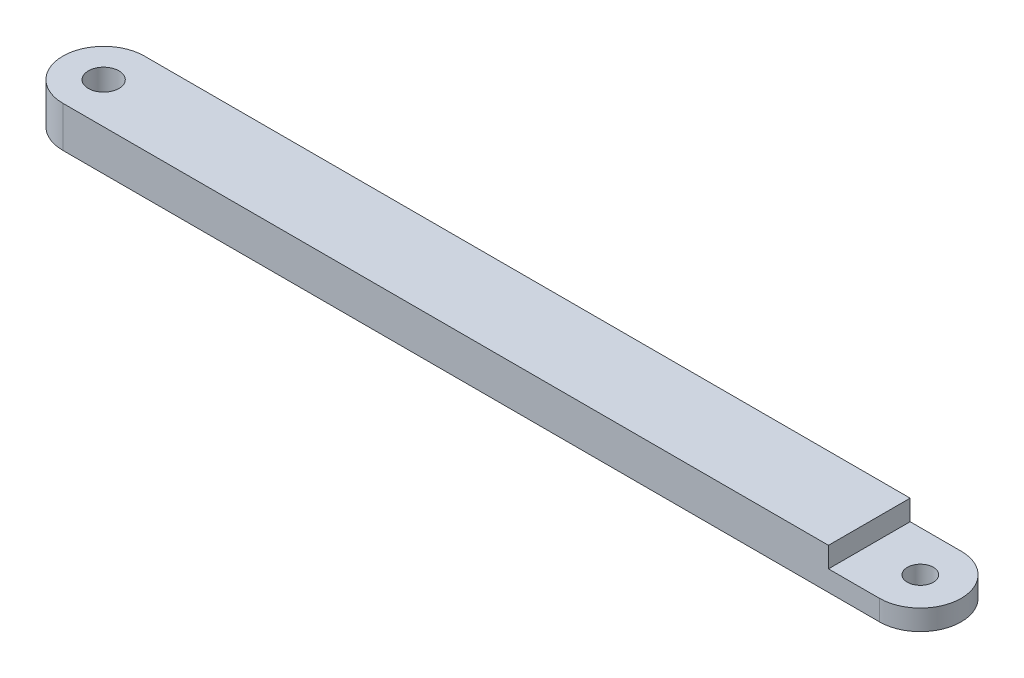
ISO-10303-21;
HEADER;
FILE_DESCRIPTION(('STEP AP214'),'2;1');
FILE_NAME('part.step','',(''),(''),'','','');
FILE_SCHEMA(('AUTOMOTIVE_DESIGN { 1 0 10303 214 1 1 1 1 }'));
ENDSEC;
DATA;
#1=APPLICATION_CONTEXT('core data for automotive mechanical design processes');
#2=APPLICATION_PROTOCOL_DEFINITION('international standard','automotive_design',2000,#1);
#3=PRODUCT_CONTEXT('',#1,'mechanical');
#4=PRODUCT('Part','Part','',(#3));
#5=PRODUCT_RELATED_PRODUCT_CATEGORY('part','',(#4));
#6=PRODUCT_DEFINITION_FORMATION('','',#4);
#7=PRODUCT_DEFINITION_CONTEXT('part definition',#1,'design');
#8=PRODUCT_DEFINITION('design','',#6,#7);
#9=PRODUCT_DEFINITION_SHAPE('','',#8);
#10=(LENGTH_UNIT() NAMED_UNIT(*) SI_UNIT(.MILLI.,.METRE.));
#11=(NAMED_UNIT(*) PLANE_ANGLE_UNIT() SI_UNIT($,.RADIAN.));
#12=(NAMED_UNIT(*) SI_UNIT($,.STERADIAN.) SOLID_ANGLE_UNIT());
#13=UNCERTAINTY_MEASURE_WITH_UNIT(LENGTH_MEASURE(1.E-05),#10,'distance_accuracy_value','');
#14=(GEOMETRIC_REPRESENTATION_CONTEXT(3) GLOBAL_UNCERTAINTY_ASSIGNED_CONTEXT((#13)) GLOBAL_UNIT_ASSIGNED_CONTEXT((#10,
#11,#12)) REPRESENTATION_CONTEXT('',''));
#15=CARTESIAN_POINT('',(0.,0.,0.));
#16=DIRECTION('',(0.,0.,1.));
#17=DIRECTION('',(1.,0.,0.));
#18=AXIS2_PLACEMENT_3D('',#15,#16,#17);
#19=CARTESIAN_POINT('',(63.5,6.35,0.));
#20=DIRECTION('',(0.,-1.,0.));
#21=DIRECTION('',(0.,0.,-1.));
#22=AXIS2_PLACEMENT_3D('',#19,#20,#21);
#23=CYLINDRICAL_SURFACE('',#22,6.35);
#24=CARTESIAN_POINT('',(63.5,3.175,0.));
#25=DIRECTION('',(0.,1.,0.));
#26=DIRECTION('',(0.,0.,1.));
#27=AXIS2_PLACEMENT_3D('',#24,#25,#26);
#28=CIRCLE('',#27,6.35);
#29=CARTESIAN_POINT('',(63.5,3.175,6.34999999999998));
#30=VERTEX_POINT('',#29);
#31=CARTESIAN_POINT('',(63.5,3.175,-6.35000000000002));
#32=VERTEX_POINT('',#31);
#33=EDGE_CURVE('E114',#30,#32,#28,.T.);
#34=ORIENTED_EDGE('',*,*,#33,.F.);
#35=DIRECTION('',(0.,-1.,0.));
#36=VECTOR('',#35,1.);
#37=CARTESIAN_POINT('',(63.5,6.35,6.34999999999998));
#38=LINE('',#37,#36);
#39=CARTESIAN_POINT('',(63.5,0.,6.34999999999998));
#40=VERTEX_POINT('',#39);
#41=EDGE_CURVE('E42',#30,#40,#38,.T.);
#42=ORIENTED_EDGE('',*,*,#41,.T.);
#43=CARTESIAN_POINT('',(63.5,0.,0.));
#44=DIRECTION('',(0.,1.,0.));
#45=DIRECTION('',(0.,0.,1.));
#46=AXIS2_PLACEMENT_3D('',#43,#44,#45);
#47=CIRCLE('',#46,6.35);
#48=CARTESIAN_POINT('',(63.5,0.,-6.35000000000002));
#49=VERTEX_POINT('',#48);
#50=EDGE_CURVE('E89',#40,#49,#47,.T.);
#51=ORIENTED_EDGE('',*,*,#50,.T.);
#52=DIRECTION('',(0.,-1.,0.));
#53=VECTOR('',#52,1.);
#54=CARTESIAN_POINT('',(63.5,6.35,-6.35000000000002));
#55=LINE('',#54,#53);
#56=EDGE_CURVE('E83',#32,#49,#55,.T.);
#57=ORIENTED_EDGE('',*,*,#56,.F.);
#58=EDGE_LOOP('',(#34,#42,#51,#57));
#59=FACE_BOUND('',#58,.T.);
#60=ADVANCED_FACE('F33',(#59),#23,.T.);
#61=CARTESIAN_POINT('',(63.5,6.35,0.));
#62=DIRECTION('',(0.,1.,0.));
#63=DIRECTION('',(0.,0.,1.));
#64=AXIS2_PLACEMENT_3D('',#61,#62,#63);
#65=CYLINDRICAL_SURFACE('',#64,2.0193);
#66=CARTESIAN_POINT('',(63.5,0.,0.));
#67=DIRECTION('',(0.,1.,0.));
#68=DIRECTION('',(0.,0.,1.));
#69=AXIS2_PLACEMENT_3D('',#66,#67,#68);
#70=CIRCLE('',#69,2.0193);
#71=CARTESIAN_POINT('',(63.5,0.,2.01929999999998));
#72=VERTEX_POINT('',#71);
#73=EDGE_CURVE('E130',#72,#72,#70,.T.);
#74=ORIENTED_EDGE('',*,*,#73,.F.);
#75=EDGE_LOOP('',(#74));
#76=FACE_BOUND('',#75,.T.);
#77=CARTESIAN_POINT('',(63.5,3.175,0.));
#78=DIRECTION('',(0.,1.,0.));
#79=DIRECTION('',(0.,0.,1.));
#80=AXIS2_PLACEMENT_3D('',#77,#78,#79);
#81=CIRCLE('',#80,2.0193);
#82=CARTESIAN_POINT('',(63.5,3.175,2.01929999999998));
#83=VERTEX_POINT('',#82);
#84=EDGE_CURVE('E37',#83,#83,#81,.F.);
#85=ORIENTED_EDGE('',*,*,#84,.F.);
#86=EDGE_LOOP('',(#85));
#87=FACE_BOUND('',#86,.T.);
#88=ADVANCED_FACE('F166',(#76,#87),#65,.F.);
#89=CARTESIAN_POINT('',(-63.5,6.35,0.));
#90=DIRECTION('',(0.,-1.,0.));
#91=DIRECTION('',(0.,0.,-1.));
#92=AXIS2_PLACEMENT_3D('',#89,#90,#91);
#93=CYLINDRICAL_SURFACE('',#92,6.35);
#94=CARTESIAN_POINT('',(-63.5,0.,0.));
#95=DIRECTION('',(0.,1.,0.));
#96=DIRECTION('',(0.,0.,1.));
#97=AXIS2_PLACEMENT_3D('',#94,#95,#96);
#98=CIRCLE('',#97,6.35);
#99=CARTESIAN_POINT('',(-63.5,0.,-6.35));
#100=VERTEX_POINT('',#99);
#101=CARTESIAN_POINT('',(-63.5,0.,6.35));
#102=VERTEX_POINT('',#101);
#103=EDGE_CURVE('E94',#100,#102,#98,.T.);
#104=ORIENTED_EDGE('',*,*,#103,.T.);
#105=DIRECTION('',(0.,-1.,0.));
#106=VECTOR('',#105,1.);
#107=CARTESIAN_POINT('',(-63.5,6.35,6.35));
#108=LINE('',#107,#106);
#109=CARTESIAN_POINT('',(-63.5,6.35,6.35));
#110=VERTEX_POINT('',#109);
#111=EDGE_CURVE('E11',#110,#102,#108,.T.);
#112=ORIENTED_EDGE('',*,*,#111,.F.);
#113=CARTESIAN_POINT('',(-63.5,6.35,0.));
#114=DIRECTION('',(0.,1.,0.));
#115=DIRECTION('',(0.,0.,1.));
#116=AXIS2_PLACEMENT_3D('',#113,#114,#115);
#117=CIRCLE('',#116,6.35);
#118=CARTESIAN_POINT('',(-63.5,6.35,-6.35));
#119=VERTEX_POINT('',#118);
#120=EDGE_CURVE('E88',#119,#110,#117,.T.);
#121=ORIENTED_EDGE('',*,*,#120,.F.);
#122=DIRECTION('',(0.,-1.,0.));
#123=VECTOR('',#122,1.);
#124=CARTESIAN_POINT('',(-63.5,6.35,-6.35));
#125=LINE('',#124,#123);
#126=EDGE_CURVE('E79',#119,#100,#125,.T.);
#127=ORIENTED_EDGE('',*,*,#126,.T.);
#128=EDGE_LOOP('',(#104,#112,#121,#127));
#129=FACE_BOUND('',#128,.T.);
#130=ADVANCED_FACE('F35',(#129),#93,.T.);
#131=CARTESIAN_POINT('',(-63.5,6.35,6.35));
#132=DIRECTION('',(0.,0.,-1.));
#133=DIRECTION('',(-1.,0.,0.));
#134=AXIS2_PLACEMENT_3D('',#131,#132,#133);
#135=PLANE('',#134);
#136=DIRECTION('',(1.,0.,0.));
#137=VECTOR('',#136,1.);
#138=CARTESIAN_POINT('',(71.4375,3.175,6.34999999999998));
#139=LINE('',#138,#137);
#140=CARTESIAN_POINT('',(55.5625,3.175,6.34999999999998));
#141=VERTEX_POINT('',#140);
#142=EDGE_CURVE('E142',#141,#30,#139,.T.);
#143=ORIENTED_EDGE('',*,*,#142,.F.);
#144=DIRECTION('',(0.,1.,0.));
#145=VECTOR('',#144,1.);
#146=CARTESIAN_POINT('',(55.5625,3.175,6.34999999999998));
#147=LINE('',#146,#145);
#148=CARTESIAN_POINT('',(55.5625,6.35,6.34999999999998));
#149=VERTEX_POINT('',#148);
#150=EDGE_CURVE('E123',#141,#149,#147,.T.);
#151=ORIENTED_EDGE('',*,*,#150,.T.);
#152=DIRECTION('',(1.,0.,0.));
#153=VECTOR('',#152,1.);
#154=CARTESIAN_POINT('',(-63.5,6.35,6.35));
#155=LINE('',#154,#153);
#156=EDGE_CURVE('E120',#110,#149,#155,.T.);
#157=ORIENTED_EDGE('',*,*,#156,.F.);
#158=ORIENTED_EDGE('',*,*,#111,.T.);
#159=DIRECTION('',(1.,0.,0.));
#160=VECTOR('',#159,1.);
#161=CARTESIAN_POINT('',(-63.5,0.,6.35));
#162=LINE('',#161,#160);
#163=EDGE_CURVE('E98',#102,#40,#162,.T.);
#164=ORIENTED_EDGE('',*,*,#163,.T.);
#165=ORIENTED_EDGE('',*,*,#41,.F.);
#166=EDGE_LOOP('',(#143,#151,#157,#158,#164,#165));
#167=FACE_BOUND('',#166,.T.);
#168=ADVANCED_FACE('F117',(#167),#135,.F.);
#169=CARTESIAN_POINT('',(-63.5,6.35,-6.35));
#170=DIRECTION('',(0.,0.,1.));
#171=DIRECTION('',(1.,0.,0.));
#172=AXIS2_PLACEMENT_3D('',#169,#170,#171);
#173=PLANE('',#172);
#174=DIRECTION('',(-1.,0.,0.));
#175=VECTOR('',#174,1.);
#176=CARTESIAN_POINT('',(-63.5,6.35,-6.35));
#177=LINE('',#176,#175);
#178=CARTESIAN_POINT('',(55.5625,6.35,-6.35000000000002));
#179=VERTEX_POINT('',#178);
#180=EDGE_CURVE('E57',#179,#119,#177,.T.);
#181=ORIENTED_EDGE('',*,*,#180,.F.);
#182=DIRECTION('',(0.,1.,0.));
#183=VECTOR('',#182,1.);
#184=CARTESIAN_POINT('',(55.5625,3.175,-6.35000000000002));
#185=LINE('',#184,#183);
#186=CARTESIAN_POINT('',(55.5625,3.175,-6.35000000000002));
#187=VERTEX_POINT('',#186);
#188=EDGE_CURVE('E49',#187,#179,#185,.T.);
#189=ORIENTED_EDGE('',*,*,#188,.F.);
#190=DIRECTION('',(-1.,0.,0.));
#191=VECTOR('',#190,1.);
#192=CARTESIAN_POINT('',(71.4375,3.175,-6.35000000000002));
#193=LINE('',#192,#191);
#194=EDGE_CURVE('E135',#32,#187,#193,.T.);
#195=ORIENTED_EDGE('',*,*,#194,.F.);
#196=ORIENTED_EDGE('',*,*,#56,.T.);
#197=DIRECTION('',(-1.,0.,0.));
#198=VECTOR('',#197,1.);
#199=CARTESIAN_POINT('',(-63.5,0.,-6.35));
#200=LINE('',#199,#198);
#201=EDGE_CURVE('E76',#49,#100,#200,.T.);
#202=ORIENTED_EDGE('',*,*,#201,.T.);
#203=ORIENTED_EDGE('',*,*,#126,.F.);
#204=EDGE_LOOP('',(#181,#189,#195,#196,#202,#203));
#205=FACE_BOUND('',#204,.T.);
#206=ADVANCED_FACE('F78',(#205),#173,.F.);
#207=CARTESIAN_POINT('',(-63.5,6.35,0.));
#208=DIRECTION('',(0.,1.,0.));
#209=DIRECTION('',(0.,0.,1.));
#210=AXIS2_PLACEMENT_3D('',#207,#208,#209);
#211=PLANE('',#210);
#212=DIRECTION('',(0.,0.,1.));
#213=VECTOR('',#212,1.);
#214=CARTESIAN_POINT('',(55.5625,6.35,6.34999999999998));
#215=LINE('',#214,#213);
#216=EDGE_CURVE('E137',#179,#149,#215,.T.);
#217=ORIENTED_EDGE('',*,*,#216,.F.);
#218=ORIENTED_EDGE('',*,*,#180,.T.);
#219=ORIENTED_EDGE('',*,*,#120,.T.);
#220=ORIENTED_EDGE('',*,*,#156,.T.);
#221=EDGE_LOOP('',(#217,#218,#219,#220));
#222=FACE_BOUND('',#221,.T.);
#223=CARTESIAN_POINT('',(-63.5,6.35,0.));
#224=DIRECTION('',(0.,1.,0.));
#225=DIRECTION('',(0.,0.,1.));
#226=AXIS2_PLACEMENT_3D('',#223,#224,#225);
#227=CIRCLE('',#226,2.38125);
#228=CARTESIAN_POINT('',(-63.5,6.35,2.38125));
#229=VERTEX_POINT('',#228);
#230=EDGE_CURVE('E103',#229,#229,#227,.T.);
#231=ORIENTED_EDGE('',*,*,#230,.F.);
#232=EDGE_LOOP('',(#231));
#233=FACE_BOUND('',#232,.T.);
#234=ADVANCED_FACE('F124',(#222,#233),#211,.T.);
#235=CARTESIAN_POINT('',(-63.5,0.,0.));
#236=DIRECTION('',(0.,1.,0.));
#237=DIRECTION('',(0.,0.,1.));
#238=AXIS2_PLACEMENT_3D('',#235,#236,#237);
#239=PLANE('',#238);
#240=ORIENTED_EDGE('',*,*,#73,.T.);
#241=EDGE_LOOP('',(#240));
#242=FACE_BOUND('',#241,.T.);
#243=CARTESIAN_POINT('',(-63.5,0.,0.));
#244=DIRECTION('',(0.,1.,0.));
#245=DIRECTION('',(0.,0.,1.));
#246=AXIS2_PLACEMENT_3D('',#243,#244,#245);
#247=CIRCLE('',#246,2.38125);
#248=CARTESIAN_POINT('',(-63.5,0.,2.38125));
#249=VERTEX_POINT('',#248);
#250=EDGE_CURVE('E99',#249,#249,#247,.T.);
#251=ORIENTED_EDGE('',*,*,#250,.T.);
#252=EDGE_LOOP('',(#251));
#253=FACE_BOUND('',#252,.T.);
#254=ORIENTED_EDGE('',*,*,#103,.F.);
#255=ORIENTED_EDGE('',*,*,#201,.F.);
#256=ORIENTED_EDGE('',*,*,#50,.F.);
#257=ORIENTED_EDGE('',*,*,#163,.F.);
#258=EDGE_LOOP('',(#254,#255,#256,#257));
#259=FACE_BOUND('',#258,.T.);
#260=ADVANCED_FACE('F96',(#242,#253,#259),#239,.F.);
#261=CARTESIAN_POINT('',(-63.5,6.35,0.));
#262=DIRECTION('',(0.,1.,0.));
#263=DIRECTION('',(0.,0.,1.));
#264=AXIS2_PLACEMENT_3D('',#261,#262,#263);
#265=CYLINDRICAL_SURFACE('',#264,2.38125);
#266=ORIENTED_EDGE('',*,*,#250,.F.);
#267=EDGE_LOOP('',(#266));
#268=FACE_BOUND('',#267,.T.);
#269=ORIENTED_EDGE('',*,*,#230,.T.);
#270=EDGE_LOOP('',(#269));
#271=FACE_BOUND('',#270,.T.);
#272=ADVANCED_FACE('F161',(#268,#271),#265,.F.);
#273=CARTESIAN_POINT('',(0.,3.175,0.));
#274=DIRECTION('',(0.,1.,0.));
#275=DIRECTION('',(0.,0.,1.));
#276=AXIS2_PLACEMENT_3D('',#273,#274,#275);
#277=PLANE('',#276);
#278=ORIENTED_EDGE('',*,*,#84,.T.);
#279=EDGE_LOOP('',(#278));
#280=FACE_BOUND('',#279,.T.);
#281=ORIENTED_EDGE('',*,*,#33,.T.);
#282=ORIENTED_EDGE('',*,*,#194,.T.);
#283=DIRECTION('',(0.,0.,1.));
#284=VECTOR('',#283,1.);
#285=CARTESIAN_POINT('',(55.5625,3.175,6.34999999999998));
#286=LINE('',#285,#284);
#287=EDGE_CURVE('E139',#187,#141,#286,.T.);
#288=ORIENTED_EDGE('',*,*,#287,.T.);
#289=ORIENTED_EDGE('',*,*,#142,.T.);
#290=EDGE_LOOP('',(#281,#282,#288,#289));
#291=FACE_BOUND('',#290,.T.);
#292=ADVANCED_FACE('F148',(#280,#291),#277,.T.);
#293=CARTESIAN_POINT('',(55.5625,3.175,6.34999999999998));
#294=DIRECTION('',(-1.,0.,0.));
#295=DIRECTION('',(0.,0.,1.));
#296=AXIS2_PLACEMENT_3D('',#293,#294,#295);
#297=PLANE('',#296);
#298=ORIENTED_EDGE('',*,*,#216,.T.);
#299=ORIENTED_EDGE('',*,*,#150,.F.);
#300=ORIENTED_EDGE('',*,*,#287,.F.);
#301=ORIENTED_EDGE('',*,*,#188,.T.);
#302=EDGE_LOOP('',(#298,#299,#300,#301));
#303=FACE_BOUND('',#302,.T.);
#304=ADVANCED_FACE('F151',(#303),#297,.F.);
#305=CLOSED_SHELL('',(#60,#88,#130,#168,#206,#234,#260,#272,#292,#304));
#306=MANIFOLD_SOLID_BREP('B2',#305);
#307=ADVANCED_BREP_SHAPE_REPRESENTATION('',(#18,#306),#14);
#308=SHAPE_DEFINITION_REPRESENTATION(#9,#307);
ENDSEC;
END-ISO-10303-21;
